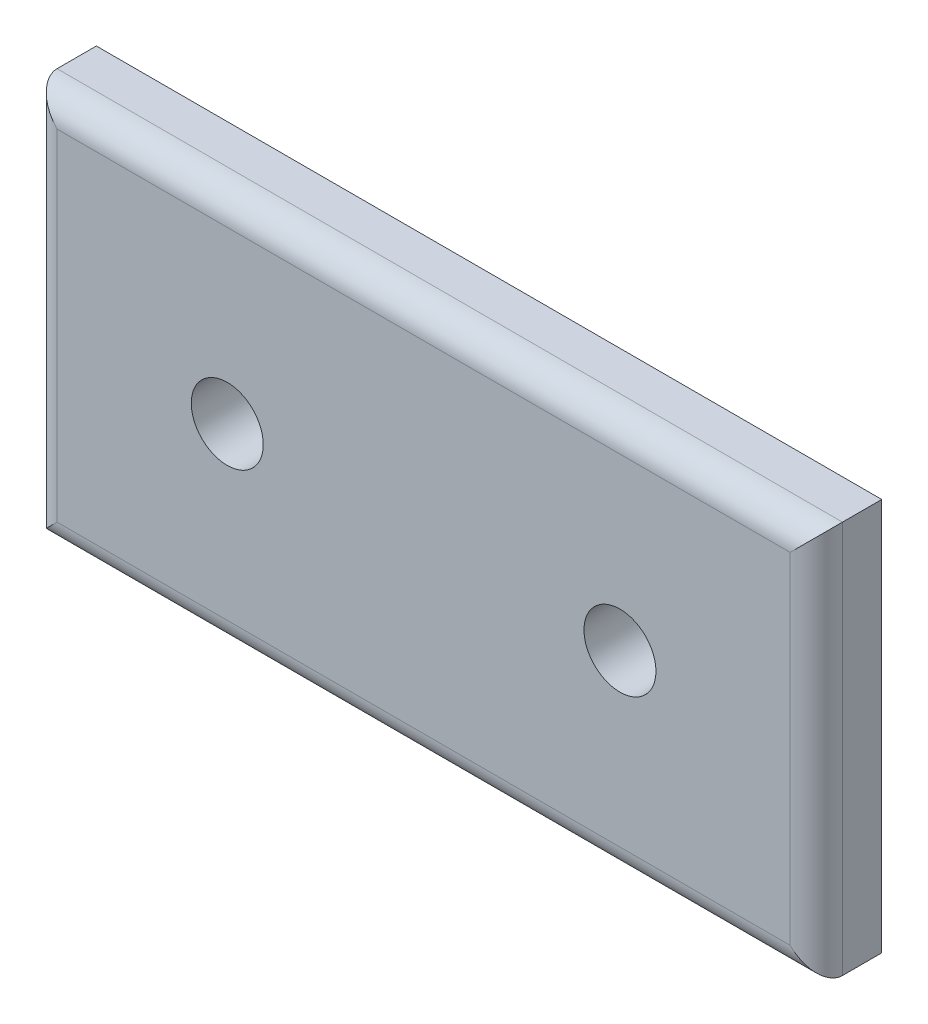
ISO-10303-21;
HEADER;
FILE_DESCRIPTION(('STEP AP214'),'2;1');
FILE_NAME('part.step','',(''),(''),'','','');
FILE_SCHEMA(('AUTOMOTIVE_DESIGN { 1 0 10303 214 1 1 1 1 }'));
ENDSEC;
DATA;
#1=APPLICATION_CONTEXT('core data for automotive mechanical design processes');
#2=APPLICATION_PROTOCOL_DEFINITION('international standard','automotive_design',2000,#1);
#3=PRODUCT_CONTEXT('',#1,'mechanical');
#4=PRODUCT('Part','Part','',(#3));
#5=PRODUCT_RELATED_PRODUCT_CATEGORY('part','',(#4));
#6=PRODUCT_DEFINITION_FORMATION('','',#4);
#7=PRODUCT_DEFINITION_CONTEXT('part definition',#1,'design');
#8=PRODUCT_DEFINITION('design','',#6,#7);
#9=PRODUCT_DEFINITION_SHAPE('','',#8);
#10=(LENGTH_UNIT() NAMED_UNIT(*) SI_UNIT(.MILLI.,.METRE.));
#11=(NAMED_UNIT(*) PLANE_ANGLE_UNIT() SI_UNIT($,.RADIAN.));
#12=(NAMED_UNIT(*) SI_UNIT($,.STERADIAN.) SOLID_ANGLE_UNIT());
#13=UNCERTAINTY_MEASURE_WITH_UNIT(LENGTH_MEASURE(1.E-05),#10,'distance_accuracy_value','');
#14=(GEOMETRIC_REPRESENTATION_CONTEXT(3) GLOBAL_UNCERTAINTY_ASSIGNED_CONTEXT((#13)) GLOBAL_UNIT_ASSIGNED_CONTEXT((#10,
#11,#12)) REPRESENTATION_CONTEXT('',''));
#15=CARTESIAN_POINT('',(0.,0.,0.));
#16=DIRECTION('',(0.,0.,1.));
#17=DIRECTION('',(1.,0.,0.));
#18=AXIS2_PLACEMENT_3D('',#15,#16,#17);
#19=CARTESIAN_POINT('',(0.,0.,6.35));
#20=DIRECTION('',(1.,0.,0.));
#21=DIRECTION('',(0.,0.,-1.));
#22=AXIS2_PLACEMENT_3D('',#19,#20,#21);
#23=PLANE('',#22);
#24=DIRECTION('',(0.,0.,-1.));
#25=VECTOR('',#24,1.);
#26=CARTESIAN_POINT('',(0.,0.,6.35));
#27=LINE('',#26,#25);
#28=CARTESIAN_POINT('',(0.,0.,3.81));
#29=VERTEX_POINT('',#28);
#30=CARTESIAN_POINT('',(0.,0.,0.));
#31=VERTEX_POINT('',#30);
#32=EDGE_CURVE('E93',#29,#31,#27,.T.);
#33=ORIENTED_EDGE('',*,*,#32,.F.);
#34=DIRECTION('',(0.,-1.,0.));
#35=VECTOR('',#34,1.);
#36=CARTESIAN_POINT('',(0.,0.,3.81));
#37=LINE('',#36,#35);
#38=CARTESIAN_POINT('',(0.,38.1,3.81));
#39=VERTEX_POINT('',#38);
#40=EDGE_CURVE('E11',#29,#39,#37,.F.);
#41=ORIENTED_EDGE('',*,*,#40,.T.);
#42=DIRECTION('',(0.,0.,-1.));
#43=VECTOR('',#42,1.);
#44=CARTESIAN_POINT('',(0.,38.1,6.35));
#45=LINE('',#44,#43);
#46=CARTESIAN_POINT('',(0.,38.1,0.));
#47=VERTEX_POINT('',#46);
#48=EDGE_CURVE('E113',#39,#47,#45,.T.);
#49=ORIENTED_EDGE('',*,*,#48,.T.);
#50=DIRECTION('',(0.,-1.,0.));
#51=VECTOR('',#50,1.);
#52=CARTESIAN_POINT('',(0.,0.,0.));
#53=LINE('',#52,#51);
#54=EDGE_CURVE('E108',#47,#31,#53,.T.);
#55=ORIENTED_EDGE('',*,*,#54,.T.);
#56=EDGE_LOOP('',(#33,#41,#49,#55));
#57=FACE_BOUND('',#56,.T.);
#58=ADVANCED_FACE('F41',(#57),#23,.F.);
#59=CARTESIAN_POINT('',(0.,0.,6.35));
#60=DIRECTION('',(0.,1.,0.));
#61=DIRECTION('',(0.,0.,1.));
#62=AXIS2_PLACEMENT_3D('',#59,#60,#61);
#63=PLANE('',#62);
#64=DIRECTION('',(0.,0.,-1.));
#65=VECTOR('',#64,1.);
#66=CARTESIAN_POINT('',(76.2,0.,6.35));
#67=LINE('',#66,#65);
#68=CARTESIAN_POINT('',(76.2,0.,3.81));
#69=VERTEX_POINT('',#68);
#70=CARTESIAN_POINT('',(76.2,0.,0.));
#71=VERTEX_POINT('',#70);
#72=EDGE_CURVE('E102',#69,#71,#67,.T.);
#73=ORIENTED_EDGE('',*,*,#72,.F.);
#74=DIRECTION('',(1.,0.,0.));
#75=VECTOR('',#74,1.);
#76=CARTESIAN_POINT('',(0.,0.,3.81));
#77=LINE('',#76,#75);
#78=EDGE_CURVE('E50',#69,#29,#77,.F.);
#79=ORIENTED_EDGE('',*,*,#78,.T.);
#80=ORIENTED_EDGE('',*,*,#32,.T.);
#81=DIRECTION('',(1.,0.,0.));
#82=VECTOR('',#81,1.);
#83=CARTESIAN_POINT('',(0.,0.,0.));
#84=LINE('',#83,#82);
#85=EDGE_CURVE('E96',#31,#71,#84,.T.);
#86=ORIENTED_EDGE('',*,*,#85,.T.);
#87=EDGE_LOOP('',(#73,#79,#80,#86));
#88=FACE_BOUND('',#87,.T.);
#89=ADVANCED_FACE('F95',(#88),#63,.F.);
#90=CARTESIAN_POINT('',(76.2,0.,6.35));
#91=DIRECTION('',(-1.,0.,0.));
#92=DIRECTION('',(0.,0.,1.));
#93=AXIS2_PLACEMENT_3D('',#90,#91,#92);
#94=PLANE('',#93);
#95=DIRECTION('',(0.,0.,-1.));
#96=VECTOR('',#95,1.);
#97=CARTESIAN_POINT('',(76.2,38.1,6.35));
#98=LINE('',#97,#96);
#99=CARTESIAN_POINT('',(76.2,38.1,3.81));
#100=VERTEX_POINT('',#99);
#101=CARTESIAN_POINT('',(76.2,38.1,0.));
#102=VERTEX_POINT('',#101);
#103=EDGE_CURVE('E126',#100,#102,#98,.T.);
#104=ORIENTED_EDGE('',*,*,#103,.F.);
#105=DIRECTION('',(0.,1.,0.));
#106=VECTOR('',#105,1.);
#107=CARTESIAN_POINT('',(76.2,0.,3.81));
#108=LINE('',#107,#106);
#109=EDGE_CURVE('E65',#100,#69,#108,.F.);
#110=ORIENTED_EDGE('',*,*,#109,.T.);
#111=ORIENTED_EDGE('',*,*,#72,.T.);
#112=DIRECTION('',(0.,1.,0.));
#113=VECTOR('',#112,1.);
#114=CARTESIAN_POINT('',(76.2,0.,0.));
#115=LINE('',#114,#113);
#116=EDGE_CURVE('E110',#71,#102,#115,.T.);
#117=ORIENTED_EDGE('',*,*,#116,.T.);
#118=EDGE_LOOP('',(#104,#110,#111,#117));
#119=FACE_BOUND('',#118,.T.);
#120=ADVANCED_FACE('F165',(#119),#94,.F.);
#121=CARTESIAN_POINT('',(0.,38.1,6.35));
#122=DIRECTION('',(0.,-1.,0.));
#123=DIRECTION('',(0.,0.,-1.));
#124=AXIS2_PLACEMENT_3D('',#121,#122,#123);
#125=PLANE('',#124);
#126=ORIENTED_EDGE('',*,*,#48,.F.);
#127=DIRECTION('',(-1.,0.,0.));
#128=VECTOR('',#127,1.);
#129=CARTESIAN_POINT('',(0.,38.1,3.81));
#130=LINE('',#129,#128);
#131=EDGE_CURVE('E137',#39,#100,#130,.F.);
#132=ORIENTED_EDGE('',*,*,#131,.T.);
#133=ORIENTED_EDGE('',*,*,#103,.T.);
#134=DIRECTION('',(-1.,0.,0.));
#135=VECTOR('',#134,1.);
#136=CARTESIAN_POINT('',(0.,38.1,0.));
#137=LINE('',#136,#135);
#138=EDGE_CURVE('E123',#102,#47,#137,.T.);
#139=ORIENTED_EDGE('',*,*,#138,.T.);
#140=EDGE_LOOP('',(#126,#132,#133,#139));
#141=FACE_BOUND('',#140,.T.);
#142=ADVANCED_FACE('F164',(#141),#125,.F.);
#143=CARTESIAN_POINT('',(0.,0.,6.35));
#144=DIRECTION('',(0.,0.,-1.));
#145=DIRECTION('',(-1.,0.,0.));
#146=AXIS2_PLACEMENT_3D('',#143,#144,#145);
#147=PLANE('',#146);
#148=CARTESIAN_POINT('',(19.05,19.05,6.35));
#149=DIRECTION('',(0.,0.,1.));
#150=DIRECTION('',(1.,0.,0.));
#151=AXIS2_PLACEMENT_3D('',#148,#149,#150);
#152=CIRCLE('',#151,3.4925);
#153=CARTESIAN_POINT('',(22.5425,19.05,6.35));
#154=VERTEX_POINT('',#153);
#155=EDGE_CURVE('E214',#154,#154,#152,.T.);
#156=ORIENTED_EDGE('',*,*,#155,.F.);
#157=EDGE_LOOP('',(#156));
#158=FACE_BOUND('',#157,.T.);
#159=CARTESIAN_POINT('',(57.15,19.05,6.35));
#160=DIRECTION('',(0.,0.,1.));
#161=DIRECTION('',(1.,0.,0.));
#162=AXIS2_PLACEMENT_3D('',#159,#160,#161);
#163=CIRCLE('',#162,3.4925);
#164=CARTESIAN_POINT('',(60.6425,19.05,6.35));
#165=VERTEX_POINT('',#164);
#166=EDGE_CURVE('E215',#165,#165,#163,.T.);
#167=ORIENTED_EDGE('',*,*,#166,.F.);
#168=EDGE_LOOP('',(#167));
#169=FACE_BOUND('',#168,.T.);
#170=DIRECTION('',(0.,1.,0.));
#171=VECTOR('',#170,1.);
#172=CARTESIAN_POINT('',(73.66,0.,6.35));
#173=LINE('',#172,#171);
#174=CARTESIAN_POINT('',(73.66,2.54,6.35));
#175=VERTEX_POINT('',#174);
#176=CARTESIAN_POINT('',(73.66,35.56,6.35));
#177=VERTEX_POINT('',#176);
#178=EDGE_CURVE('E132',#175,#177,#173,.T.);
#179=ORIENTED_EDGE('',*,*,#178,.T.);
#180=DIRECTION('',(-1.,0.,0.));
#181=VECTOR('',#180,1.);
#182=CARTESIAN_POINT('',(0.,35.56,6.35));
#183=LINE('',#182,#181);
#184=CARTESIAN_POINT('',(2.54,35.56,6.35));
#185=VERTEX_POINT('',#184);
#186=EDGE_CURVE('E134',#177,#185,#183,.T.);
#187=ORIENTED_EDGE('',*,*,#186,.T.);
#188=DIRECTION('',(0.,-1.,0.));
#189=VECTOR('',#188,1.);
#190=CARTESIAN_POINT('',(2.54,0.,6.35));
#191=LINE('',#190,#189);
#192=CARTESIAN_POINT('',(2.54,2.54,6.35));
#193=VERTEX_POINT('',#192);
#194=EDGE_CURVE('E101',#185,#193,#191,.T.);
#195=ORIENTED_EDGE('',*,*,#194,.T.);
#196=DIRECTION('',(1.,0.,0.));
#197=VECTOR('',#196,1.);
#198=CARTESIAN_POINT('',(0.,2.54,6.35));
#199=LINE('',#198,#197);
#200=EDGE_CURVE('E130',#193,#175,#199,.T.);
#201=ORIENTED_EDGE('',*,*,#200,.T.);
#202=EDGE_LOOP('',(#179,#187,#195,#201));
#203=FACE_BOUND('',#202,.T.);
#204=ADVANCED_FACE('F157',(#158,#169,#203),#147,.F.);
#205=CARTESIAN_POINT('',(0.,0.,0.));
#206=DIRECTION('',(0.,0.,-1.));
#207=DIRECTION('',(-1.,0.,0.));
#208=AXIS2_PLACEMENT_3D('',#205,#206,#207);
#209=PLANE('',#208);
#210=CARTESIAN_POINT('',(19.05,19.05,0.));
#211=DIRECTION('',(0.,0.,1.));
#212=DIRECTION('',(1.,0.,0.));
#213=AXIS2_PLACEMENT_3D('',#210,#211,#212);
#214=CIRCLE('',#213,3.4925);
#215=CARTESIAN_POINT('',(22.5425,19.05,0.));
#216=VERTEX_POINT('',#215);
#217=EDGE_CURVE('E145',#216,#216,#214,.T.);
#218=ORIENTED_EDGE('',*,*,#217,.T.);
#219=EDGE_LOOP('',(#218));
#220=FACE_BOUND('',#219,.T.);
#221=CARTESIAN_POINT('',(57.15,19.05,0.));
#222=DIRECTION('',(0.,0.,1.));
#223=DIRECTION('',(1.,0.,0.));
#224=AXIS2_PLACEMENT_3D('',#221,#222,#223);
#225=CIRCLE('',#224,3.4925);
#226=CARTESIAN_POINT('',(60.6425,19.05,0.));
#227=VERTEX_POINT('',#226);
#228=EDGE_CURVE('E119',#227,#227,#225,.T.);
#229=ORIENTED_EDGE('',*,*,#228,.T.);
#230=EDGE_LOOP('',(#229));
#231=FACE_BOUND('',#230,.T.);
#232=ORIENTED_EDGE('',*,*,#54,.F.);
#233=ORIENTED_EDGE('',*,*,#138,.F.);
#234=ORIENTED_EDGE('',*,*,#116,.F.);
#235=ORIENTED_EDGE('',*,*,#85,.F.);
#236=EDGE_LOOP('',(#232,#233,#234,#235));
#237=FACE_BOUND('',#236,.T.);
#238=ADVANCED_FACE('F106',(#220,#231,#237),#209,.T.);
#239=CARTESIAN_POINT('',(0.,2.54,3.81));
#240=DIRECTION('',(1.,0.,0.));
#241=DIRECTION('',(0.,0.,-1.));
#242=AXIS2_PLACEMENT_3D('',#239,#240,#241);
#243=CYLINDRICAL_SURFACE('',#242,2.54);
#244=CARTESIAN_POINT('',(2.54,2.54,3.81));
#245=DIRECTION('',(0.707106781186547,-0.707106781186547,0.));
#246=DIRECTION('',(-0.707106781186547,-0.707106781186547,0.));
#247=AXIS2_PLACEMENT_3D('',#244,#245,#246);
#248=ELLIPSE('',#247,3.59210244842766,2.54);
#249=EDGE_CURVE('E117',#29,#193,#248,.F.);
#250=ORIENTED_EDGE('',*,*,#249,.F.);
#251=ORIENTED_EDGE('',*,*,#78,.F.);
#252=CARTESIAN_POINT('',(73.66,2.54,3.81));
#253=DIRECTION('',(0.707106781186547,0.707106781186547,0.));
#254=DIRECTION('',(0.707106781186547,-0.707106781186547,0.));
#255=AXIS2_PLACEMENT_3D('',#252,#253,#254);
#256=ELLIPSE('',#255,3.59210244842766,2.54);
#257=EDGE_CURVE('E45',#175,#69,#256,.T.);
#258=ORIENTED_EDGE('',*,*,#257,.F.);
#259=ORIENTED_EDGE('',*,*,#200,.F.);
#260=EDGE_LOOP('',(#250,#251,#258,#259));
#261=FACE_BOUND('',#260,.T.);
#262=ADVANCED_FACE('F43',(#261),#243,.T.);
#263=CARTESIAN_POINT('',(73.66,0.,3.81));
#264=DIRECTION('',(0.,1.,0.));
#265=DIRECTION('',(0.,0.,1.));
#266=AXIS2_PLACEMENT_3D('',#263,#264,#265);
#267=CYLINDRICAL_SURFACE('',#266,2.54);
#268=ORIENTED_EDGE('',*,*,#257,.T.);
#269=ORIENTED_EDGE('',*,*,#109,.F.);
#270=CARTESIAN_POINT('',(73.66,35.56,3.81));
#271=DIRECTION('',(-0.707106781186547,0.707106781186547,0.));
#272=DIRECTION('',(0.707106781186547,0.707106781186547,0.));
#273=AXIS2_PLACEMENT_3D('',#270,#271,#272);
#274=ELLIPSE('',#273,3.59210244842766,2.54);
#275=EDGE_CURVE('E144',#177,#100,#274,.T.);
#276=ORIENTED_EDGE('',*,*,#275,.F.);
#277=ORIENTED_EDGE('',*,*,#178,.F.);
#278=EDGE_LOOP('',(#268,#269,#276,#277));
#279=FACE_BOUND('',#278,.T.);
#280=ADVANCED_FACE('F183',(#279),#267,.T.);
#281=CARTESIAN_POINT('',(2.54,0.,3.81));
#282=DIRECTION('',(0.,-1.,0.));
#283=DIRECTION('',(0.,0.,-1.));
#284=AXIS2_PLACEMENT_3D('',#281,#282,#283);
#285=CYLINDRICAL_SURFACE('',#284,2.54);
#286=ORIENTED_EDGE('',*,*,#249,.T.);
#287=ORIENTED_EDGE('',*,*,#194,.F.);
#288=CARTESIAN_POINT('',(2.54,35.56,3.81));
#289=DIRECTION('',(-0.707106781186547,-0.707106781186547,0.));
#290=DIRECTION('',(0.707106781186547,-0.707106781186547,0.));
#291=AXIS2_PLACEMENT_3D('',#288,#289,#290);
#292=ELLIPSE('',#291,3.59210244842766,2.54);
#293=EDGE_CURVE('E142',#39,#185,#292,.F.);
#294=ORIENTED_EDGE('',*,*,#293,.F.);
#295=ORIENTED_EDGE('',*,*,#40,.F.);
#296=EDGE_LOOP('',(#286,#287,#294,#295));
#297=FACE_BOUND('',#296,.T.);
#298=ADVANCED_FACE('F150',(#297),#285,.T.);
#299=CARTESIAN_POINT('',(0.,35.56,3.81));
#300=DIRECTION('',(-1.,0.,0.));
#301=DIRECTION('',(0.,0.,1.));
#302=AXIS2_PLACEMENT_3D('',#299,#300,#301);
#303=CYLINDRICAL_SURFACE('',#302,2.54);
#304=ORIENTED_EDGE('',*,*,#275,.T.);
#305=ORIENTED_EDGE('',*,*,#131,.F.);
#306=ORIENTED_EDGE('',*,*,#293,.T.);
#307=ORIENTED_EDGE('',*,*,#186,.F.);
#308=EDGE_LOOP('',(#304,#305,#306,#307));
#309=FACE_BOUND('',#308,.T.);
#310=ADVANCED_FACE('F161',(#309),#303,.T.);
#311=CARTESIAN_POINT('',(57.15,19.05,0.));
#312=DIRECTION('',(0.,0.,1.));
#313=DIRECTION('',(1.,0.,0.));
#314=AXIS2_PLACEMENT_3D('',#311,#312,#313);
#315=CYLINDRICAL_SURFACE('',#314,3.4925);
#316=ORIENTED_EDGE('',*,*,#228,.F.);
#317=EDGE_LOOP('',(#316));
#318=FACE_BOUND('',#317,.T.);
#319=ORIENTED_EDGE('',*,*,#166,.T.);
#320=EDGE_LOOP('',(#319));
#321=FACE_BOUND('',#320,.T.);
#322=ADVANCED_FACE('F181',(#318,#321),#315,.F.);
#323=CARTESIAN_POINT('',(19.05,19.05,0.));
#324=DIRECTION('',(0.,0.,1.));
#325=DIRECTION('',(1.,0.,0.));
#326=AXIS2_PLACEMENT_3D('',#323,#324,#325);
#327=CYLINDRICAL_SURFACE('',#326,3.4925);
#328=ORIENTED_EDGE('',*,*,#217,.F.);
#329=EDGE_LOOP('',(#328));
#330=FACE_BOUND('',#329,.T.);
#331=ORIENTED_EDGE('',*,*,#155,.T.);
#332=EDGE_LOOP('',(#331));
#333=FACE_BOUND('',#332,.T.);
#334=ADVANCED_FACE('F204',(#330,#333),#327,.F.);
#335=CLOSED_SHELL('',(#58,#89,#120,#142,#204,#238,#262,#280,#298,#310,#322,#334));
#336=MANIFOLD_SOLID_BREP('B2',#335);
#337=ADVANCED_BREP_SHAPE_REPRESENTATION('',(#18,#336),#14);
#338=SHAPE_DEFINITION_REPRESENTATION(#9,#337);
ENDSEC;
END-ISO-10303-21;
